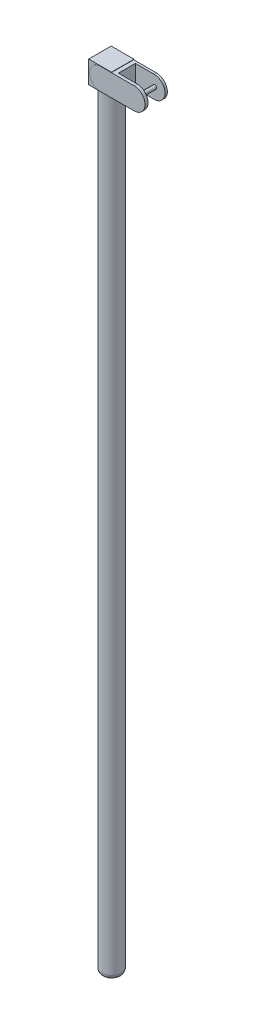
ISO-10303-21;
HEADER;
FILE_DESCRIPTION(('STEP AP214'),'2;1');
FILE_NAME('part.step','',(''),(''),'','','');
FILE_SCHEMA(('AUTOMOTIVE_DESIGN { 1 0 10303 214 1 1 1 1 }'));
ENDSEC;
DATA;
#1=APPLICATION_CONTEXT('core data for automotive mechanical design processes');
#2=APPLICATION_PROTOCOL_DEFINITION('international standard','automotive_design',2000,#1);
#3=PRODUCT_CONTEXT('',#1,'mechanical');
#4=PRODUCT('Part','Part','',(#3));
#5=PRODUCT_RELATED_PRODUCT_CATEGORY('part','',(#4));
#6=PRODUCT_DEFINITION_FORMATION('','',#4);
#7=PRODUCT_DEFINITION_CONTEXT('part definition',#1,'design');
#8=PRODUCT_DEFINITION('design','',#6,#7);
#9=PRODUCT_DEFINITION_SHAPE('','',#8);
#10=(LENGTH_UNIT() NAMED_UNIT(*) SI_UNIT(.MILLI.,.METRE.));
#11=(NAMED_UNIT(*) PLANE_ANGLE_UNIT() SI_UNIT($,.RADIAN.));
#12=(NAMED_UNIT(*) SI_UNIT($,.STERADIAN.) SOLID_ANGLE_UNIT());
#13=UNCERTAINTY_MEASURE_WITH_UNIT(LENGTH_MEASURE(1.E-05),#10,'distance_accuracy_value','');
#14=(GEOMETRIC_REPRESENTATION_CONTEXT(3) GLOBAL_UNCERTAINTY_ASSIGNED_CONTEXT((#13)) GLOBAL_UNIT_ASSIGNED_CONTEXT((#10,
#11,#12)) REPRESENTATION_CONTEXT('',''));
#15=CARTESIAN_POINT('',(0.,0.,0.));
#16=DIRECTION('',(0.,0.,1.));
#17=DIRECTION('',(1.,0.,0.));
#18=AXIS2_PLACEMENT_3D('',#15,#16,#17);
#19=CARTESIAN_POINT('',(7.54764481213233,174.500589944903,2.50000000000003));
#20=DIRECTION('',(0.,0.,-1.));
#21=DIRECTION('',(-1.,0.,0.));
#22=AXIS2_PLACEMENT_3D('',#19,#20,#21);
#23=CYLINDRICAL_SURFACE('',#22,2.43482059755223);
#24=DIRECTION('',(0.,0.,-1.));
#25=VECTOR('',#24,1.);
#26=CARTESIAN_POINT('',(7.54764481213233,176.935410542455,2.50000000000003));
#27=LINE('',#26,#25);
#28=CARTESIAN_POINT('',(7.54764481213233,176.935410542455,-1.97287008939884));
#29=VERTEX_POINT('',#28);
#30=CARTESIAN_POINT('',(7.54764481213233,176.935410542455,-2.50000000000003));
#31=VERTEX_POINT('',#30);
#32=EDGE_CURVE('E194',#29,#31,#27,.T.);
#33=ORIENTED_EDGE('',*,*,#32,.F.);
#34=CARTESIAN_POINT('',(7.54764481213233,174.500589944903,-1.97287008939884));
#35=DIRECTION('',(0.,0.,-1.));
#36=DIRECTION('',(-1.,0.,0.));
#37=AXIS2_PLACEMENT_3D('',#34,#35,#36);
#38=CIRCLE('',#37,2.43482059755223);
#39=CARTESIAN_POINT('',(7.54764481213233,172.06576934735,-1.97287008939884));
#40=VERTEX_POINT('',#39);
#41=EDGE_CURVE('E168',#29,#40,#38,.T.);
#42=ORIENTED_EDGE('',*,*,#41,.T.);
#43=DIRECTION('',(0.,0.,-1.));
#44=VECTOR('',#43,1.);
#45=CARTESIAN_POINT('',(7.54764481213233,172.06576934735,2.50000000000003));
#46=LINE('',#45,#44);
#47=CARTESIAN_POINT('',(7.54764481213233,172.06576934735,-2.50000000000003));
#48=VERTEX_POINT('',#47);
#49=EDGE_CURVE('E196',#40,#48,#46,.T.);
#50=ORIENTED_EDGE('',*,*,#49,.T.);
#51=CARTESIAN_POINT('',(7.54764481213233,174.500589944903,-2.50000000000003));
#52=DIRECTION('',(0.,0.,1.));
#53=DIRECTION('',(1.,0.,0.));
#54=AXIS2_PLACEMENT_3D('',#51,#52,#53);
#55=CIRCLE('',#54,2.43482059755223);
#56=EDGE_CURVE('E188',#48,#31,#55,.T.);
#57=ORIENTED_EDGE('',*,*,#56,.T.);
#58=EDGE_LOOP('',(#33,#42,#50,#57));
#59=FACE_BOUND('',#58,.T.);
#60=ADVANCED_FACE('F37',(#59),#23,.T.);
#61=CARTESIAN_POINT('',(2.44924478924003,172.,-2.5736655947117));
#62=DIRECTION('',(1.,0.,0.));
#63=DIRECTION('',(0.,0.,-1.));
#64=AXIS2_PLACEMENT_3D('',#61,#62,#63);
#65=PLANE('',#64);
#66=DIRECTION('',(0.,-1.,0.));
#67=VECTOR('',#66,1.);
#68=CARTESIAN_POINT('',(2.44924478924003,172.,-2.50000000000003));
#69=LINE('',#68,#67);
#70=CARTESIAN_POINT('',(2.44924478924003,176.935410542455,-2.50000000000003));
#71=VERTEX_POINT('',#70);
#72=CARTESIAN_POINT('',(2.44924478924003,172.06576934735,-2.50000000000003));
#73=VERTEX_POINT('',#72);
#74=EDGE_CURVE('E46',#71,#73,#69,.T.);
#75=ORIENTED_EDGE('',*,*,#74,.T.);
#76=DIRECTION('',(0.,0.,1.));
#77=VECTOR('',#76,1.);
#78=CARTESIAN_POINT('',(2.44924478924003,172.06576934735,-2.5736655947117));
#79=LINE('',#78,#77);
#80=CARTESIAN_POINT('',(2.44924478924003,172.06576934735,2.46932220142265));
#81=VERTEX_POINT('',#80);
#82=EDGE_CURVE('E204',#73,#81,#79,.T.);
#83=ORIENTED_EDGE('',*,*,#82,.T.);
#84=DIRECTION('',(0.,1.,0.));
#85=VECTOR('',#84,1.);
#86=CARTESIAN_POINT('',(2.44924478924003,172.,2.46932220142265));
#87=LINE('',#86,#85);
#88=CARTESIAN_POINT('',(2.44924478924003,172.,2.46932220142265));
#89=VERTEX_POINT('',#88);
#90=EDGE_CURVE('E237',#89,#81,#87,.T.);
#91=ORIENTED_EDGE('',*,*,#90,.F.);
#92=DIRECTION('',(0.,0.,-1.));
#93=VECTOR('',#92,1.);
#94=CARTESIAN_POINT('',(2.44924478924003,172.,-2.5736655947117));
#95=LINE('',#94,#93);
#96=CARTESIAN_POINT('',(2.44924478924003,172.,-2.5736655947117));
#97=VERTEX_POINT('',#96);
#98=EDGE_CURVE('E215',#89,#97,#95,.T.);
#99=ORIENTED_EDGE('',*,*,#98,.T.);
#100=DIRECTION('',(0.,1.,0.));
#101=VECTOR('',#100,1.);
#102=CARTESIAN_POINT('',(2.44924478924003,172.,-2.5736655947117));
#103=LINE('',#102,#101);
#104=CARTESIAN_POINT('',(2.44924478924003,177.,-2.5736655947117));
#105=VERTEX_POINT('',#104);
#106=EDGE_CURVE('E235',#97,#105,#103,.T.);
#107=ORIENTED_EDGE('',*,*,#106,.T.);
#108=DIRECTION('',(0.,0.,-1.));
#109=VECTOR('',#108,1.);
#110=CARTESIAN_POINT('',(2.44924478924003,177.,-2.5736655947117));
#111=LINE('',#110,#109);
#112=CARTESIAN_POINT('',(2.44924478924003,177.,2.46932220142265));
#113=VERTEX_POINT('',#112);
#114=EDGE_CURVE('E227',#113,#105,#111,.T.);
#115=ORIENTED_EDGE('',*,*,#114,.F.);
#116=CARTESIAN_POINT('',(2.44924478924003,176.935410542455,2.46932220142265));
#117=VERTEX_POINT('',#116);
#118=EDGE_CURVE('E240',#117,#113,#87,.T.);
#119=ORIENTED_EDGE('',*,*,#118,.F.);
#120=DIRECTION('',(0.,0.,-1.));
#121=VECTOR('',#120,1.);
#122=CARTESIAN_POINT('',(2.44924478924003,176.935410542455,-2.5736655947117));
#123=LINE('',#122,#121);
#124=EDGE_CURVE('E61',#117,#71,#123,.T.);
#125=ORIENTED_EDGE('',*,*,#124,.T.);
#126=EDGE_LOOP('',(#75,#83,#91,#99,#107,#115,#119,#125));
#127=FACE_BOUND('',#126,.T.);
#128=ADVANCED_FACE('F260',(#127),#65,.T.);
#129=CARTESIAN_POINT('',(-2.66599211572145,172.,2.46932220142265));
#130=DIRECTION('',(0.,0.,1.));
#131=DIRECTION('',(1.,0.,0.));
#132=AXIS2_PLACEMENT_3D('',#129,#130,#131);
#133=PLANE('',#132);
#134=ORIENTED_EDGE('',*,*,#90,.T.);
#135=DIRECTION('',(-1.,0.,0.));
#136=VECTOR('',#135,1.);
#137=CARTESIAN_POINT('',(-2.66599211572145,172.06576934735,2.46932220142265));
#138=LINE('',#137,#136);
#139=CARTESIAN_POINT('',(0.,172.06576934735,2.46932220142265));
#140=VERTEX_POINT('',#139);
#141=EDGE_CURVE('E255',#81,#140,#138,.T.);
#142=ORIENTED_EDGE('',*,*,#141,.T.);
#143=CARTESIAN_POINT('',(0.,174.500589944903,2.46932220142265));
#144=DIRECTION('',(0.,0.,1.));
#145=DIRECTION('',(1.,0.,0.));
#146=AXIS2_PLACEMENT_3D('',#143,#144,#145);
#147=CIRCLE('',#146,2.43482059755223);
#148=CARTESIAN_POINT('',(0.,176.935410542455,2.46932220142265));
#149=VERTEX_POINT('',#148);
#150=EDGE_CURVE('E252',#140,#149,#147,.F.);
#151=ORIENTED_EDGE('',*,*,#150,.T.);
#152=DIRECTION('',(1.,0.,0.));
#153=VECTOR('',#152,1.);
#154=CARTESIAN_POINT('',(-2.66599211572145,176.935410542455,2.46932220142265));
#155=LINE('',#154,#153);
#156=EDGE_CURVE('E250',#149,#117,#155,.T.);
#157=ORIENTED_EDGE('',*,*,#156,.T.);
#158=ORIENTED_EDGE('',*,*,#118,.T.);
#159=DIRECTION('',(1.,0.,0.));
#160=VECTOR('',#159,1.);
#161=CARTESIAN_POINT('',(-2.66599211572145,177.,2.46932220142265));
#162=LINE('',#161,#160);
#163=CARTESIAN_POINT('',(-2.66599211572145,177.,2.46932220142265));
#164=VERTEX_POINT('',#163);
#165=EDGE_CURVE('E224',#164,#113,#162,.T.);
#166=ORIENTED_EDGE('',*,*,#165,.F.);
#167=DIRECTION('',(0.,1.,0.));
#168=VECTOR('',#167,1.);
#169=CARTESIAN_POINT('',(-2.66599211572145,172.,2.46932220142265));
#170=LINE('',#169,#168);
#171=CARTESIAN_POINT('',(-2.66599211572145,172.,2.46932220142265));
#172=VERTEX_POINT('',#171);
#173=EDGE_CURVE('E221',#172,#164,#170,.T.);
#174=ORIENTED_EDGE('',*,*,#173,.F.);
#175=DIRECTION('',(1.,0.,0.));
#176=VECTOR('',#175,1.);
#177=CARTESIAN_POINT('',(-2.66599211572145,172.,2.46932220142265));
#178=LINE('',#177,#176);
#179=EDGE_CURVE('E211',#172,#89,#178,.T.);
#180=ORIENTED_EDGE('',*,*,#179,.T.);
#181=EDGE_LOOP('',(#134,#142,#151,#157,#158,#166,#174,#180));
#182=FACE_BOUND('',#181,.T.);
#183=ADVANCED_FACE('F274',(#182),#133,.T.);
#184=CARTESIAN_POINT('',(0.,177.,0.));
#185=DIRECTION('',(0.,-1.,0.));
#186=DIRECTION('',(0.,0.,-1.));
#187=AXIS2_PLACEMENT_3D('',#184,#185,#186);
#188=CYLINDRICAL_SURFACE('',#187,2.18750858516951);
#189=CARTESIAN_POINT('',(0.,1.,0.));
#190=DIRECTION('',(0.,1.,0.));
#191=DIRECTION('',(0.,0.,1.));
#192=AXIS2_PLACEMENT_3D('',#189,#190,#191);
#193=CIRCLE('',#192,2.18750858516951);
#194=CARTESIAN_POINT('',(0.,1.,2.18750858516951));
#195=VERTEX_POINT('',#194);
#196=EDGE_CURVE('E234',#195,#195,#193,.T.);
#197=ORIENTED_EDGE('',*,*,#196,.T.);
#198=EDGE_LOOP('',(#197));
#199=FACE_BOUND('',#198,.T.);
#200=CARTESIAN_POINT('',(0.,172.,0.));
#201=DIRECTION('',(0.,1.,0.));
#202=DIRECTION('',(0.,0.,1.));
#203=AXIS2_PLACEMENT_3D('',#200,#201,#202);
#204=CIRCLE('',#203,2.18750858516951);
#205=CARTESIAN_POINT('',(0.,172.,2.18750858516951));
#206=VERTEX_POINT('',#205);
#207=EDGE_CURVE('E247',#206,#206,#204,.T.);
#208=ORIENTED_EDGE('',*,*,#207,.F.);
#209=EDGE_LOOP('',(#208));
#210=FACE_BOUND('',#209,.T.);
#211=ADVANCED_FACE('F341',(#199,#210),#188,.T.);
#212=CARTESIAN_POINT('',(0.,0.,0.));
#213=DIRECTION('',(0.,1.,0.));
#214=DIRECTION('',(0.,0.,1.));
#215=AXIS2_PLACEMENT_3D('',#212,#213,#214);
#216=PLANE('',#215);
#217=CARTESIAN_POINT('',(0.,0.,0.));
#218=DIRECTION('',(0.,1.,0.));
#219=DIRECTION('',(0.,0.,1.));
#220=AXIS2_PLACEMENT_3D('',#217,#218,#219);
#221=CIRCLE('',#220,1.18750858516951);
#222=CARTESIAN_POINT('',(0.,0.,1.18750858516951));
#223=VERTEX_POINT('',#222);
#224=EDGE_CURVE('E244',#223,#223,#221,.F.);
#225=ORIENTED_EDGE('',*,*,#224,.T.);
#226=EDGE_LOOP('',(#225));
#227=FACE_BOUND('',#226,.T.);
#228=ADVANCED_FACE('F347',(#227),#216,.F.);
#229=CARTESIAN_POINT('',(0.,1.,0.));
#230=DIRECTION('',(0.,1.,0.));
#231=DIRECTION('',(0.,0.,1.));
#232=AXIS2_PLACEMENT_3D('',#229,#230,#231);
#233=TOROIDAL_SURFACE('',#232,1.18750858516951,1.);
#234=ORIENTED_EDGE('',*,*,#224,.F.);
#235=EDGE_LOOP('',(#234));
#236=FACE_BOUND('',#235,.T.);
#237=ORIENTED_EDGE('',*,*,#196,.F.);
#238=EDGE_LOOP('',(#237));
#239=FACE_BOUND('',#238,.T.);
#240=ADVANCED_FACE('F39',(#236,#239),#233,.T.);
#241=CARTESIAN_POINT('',(-2.66599211572145,172.,-2.5736655947117));
#242=DIRECTION('',(-1.,0.,0.));
#243=DIRECTION('',(0.,0.,1.));
#244=AXIS2_PLACEMENT_3D('',#241,#242,#243);
#245=PLANE('',#244);
#246=DIRECTION('',(0.,0.,1.));
#247=VECTOR('',#246,1.);
#248=CARTESIAN_POINT('',(-2.66599211572145,177.,-2.5736655947117));
#249=LINE('',#248,#247);
#250=CARTESIAN_POINT('',(-2.66599211572145,177.,-2.5736655947117));
#251=VERTEX_POINT('',#250);
#252=EDGE_CURVE('E207',#251,#164,#249,.T.);
#253=ORIENTED_EDGE('',*,*,#252,.F.);
#254=DIRECTION('',(0.,1.,0.));
#255=VECTOR('',#254,1.);
#256=CARTESIAN_POINT('',(-2.66599211572145,172.,-2.5736655947117));
#257=LINE('',#256,#255);
#258=CARTESIAN_POINT('',(-2.66599211572145,172.,-2.5736655947117));
#259=VERTEX_POINT('',#258);
#260=EDGE_CURVE('E232',#259,#251,#257,.T.);
#261=ORIENTED_EDGE('',*,*,#260,.F.);
#262=DIRECTION('',(0.,0.,1.));
#263=VECTOR('',#262,1.);
#264=CARTESIAN_POINT('',(-2.66599211572145,172.,-2.5736655947117));
#265=LINE('',#264,#263);
#266=EDGE_CURVE('E208',#259,#172,#265,.T.);
#267=ORIENTED_EDGE('',*,*,#266,.T.);
#268=ORIENTED_EDGE('',*,*,#173,.T.);
#269=EDGE_LOOP('',(#253,#261,#267,#268));
#270=FACE_BOUND('',#269,.T.);
#271=ADVANCED_FACE('F337',(#270),#245,.T.);
#272=CARTESIAN_POINT('',(-2.66599211572145,172.,-2.5736655947117));
#273=DIRECTION('',(0.,0.,-1.));
#274=DIRECTION('',(-1.,0.,0.));
#275=AXIS2_PLACEMENT_3D('',#272,#273,#274);
#276=PLANE('',#275);
#277=DIRECTION('',(-1.,0.,0.));
#278=VECTOR('',#277,1.);
#279=CARTESIAN_POINT('',(-2.66599211572145,177.,-2.5736655947117));
#280=LINE('',#279,#278);
#281=EDGE_CURVE('E212',#105,#251,#280,.T.);
#282=ORIENTED_EDGE('',*,*,#281,.F.);
#283=ORIENTED_EDGE('',*,*,#106,.F.);
#284=DIRECTION('',(-1.,0.,0.));
#285=VECTOR('',#284,1.);
#286=CARTESIAN_POINT('',(-2.66599211572145,172.,-2.5736655947117));
#287=LINE('',#286,#285);
#288=EDGE_CURVE('E218',#97,#259,#287,.T.);
#289=ORIENTED_EDGE('',*,*,#288,.T.);
#290=ORIENTED_EDGE('',*,*,#260,.T.);
#291=EDGE_LOOP('',(#282,#283,#289,#290));
#292=FACE_BOUND('',#291,.T.);
#293=ADVANCED_FACE('F283',(#292),#276,.T.);
#294=CARTESIAN_POINT('',(0.,172.,0.));
#295=DIRECTION('',(0.,1.,0.));
#296=DIRECTION('',(0.,0.,1.));
#297=AXIS2_PLACEMENT_3D('',#294,#295,#296);
#298=PLANE('',#297);
#299=ORIENTED_EDGE('',*,*,#207,.T.);
#300=EDGE_LOOP('',(#299));
#301=FACE_BOUND('',#300,.T.);
#302=ORIENTED_EDGE('',*,*,#266,.F.);
#303=ORIENTED_EDGE('',*,*,#288,.F.);
#304=ORIENTED_EDGE('',*,*,#98,.F.);
#305=ORIENTED_EDGE('',*,*,#179,.F.);
#306=EDGE_LOOP('',(#302,#303,#304,#305));
#307=FACE_BOUND('',#306,.T.);
#308=ADVANCED_FACE('F280',(#301,#307),#298,.F.);
#309=CARTESIAN_POINT('',(0.,177.,0.));
#310=DIRECTION('',(0.,1.,0.));
#311=DIRECTION('',(0.,0.,1.));
#312=AXIS2_PLACEMENT_3D('',#309,#310,#311);
#313=PLANE('',#312);
#314=ORIENTED_EDGE('',*,*,#252,.T.);
#315=ORIENTED_EDGE('',*,*,#165,.T.);
#316=ORIENTED_EDGE('',*,*,#114,.T.);
#317=ORIENTED_EDGE('',*,*,#281,.T.);
#318=EDGE_LOOP('',(#314,#315,#316,#317));
#319=FACE_BOUND('',#318,.T.);
#320=ADVANCED_FACE('F287',(#319),#313,.T.);
#321=CARTESIAN_POINT('',(0.,174.500589944903,2.50000000000003));
#322=DIRECTION('',(0.,0.,-1.));
#323=DIRECTION('',(-1.,0.,0.));
#324=AXIS2_PLACEMENT_3D('',#321,#322,#323);
#325=CYLINDRICAL_SURFACE('',#324,2.43482059755223);
#326=ORIENTED_EDGE('',*,*,#150,.F.);
#327=DIRECTION('',(0.,0.,-1.));
#328=VECTOR('',#327,1.);
#329=CARTESIAN_POINT('',(0.,172.06576934735,2.50000000000003));
#330=LINE('',#329,#328);
#331=CARTESIAN_POINT('',(0.,172.06576934735,2.50000000000003));
#332=VERTEX_POINT('',#331);
#333=EDGE_CURVE('E200',#332,#140,#330,.T.);
#334=ORIENTED_EDGE('',*,*,#333,.F.);
#335=CARTESIAN_POINT('',(0.,174.500589944903,2.50000000000003));
#336=DIRECTION('',(0.,0.,1.));
#337=DIRECTION('',(1.,0.,0.));
#338=AXIS2_PLACEMENT_3D('',#335,#336,#337);
#339=CIRCLE('',#338,2.43482059755223);
#340=CARTESIAN_POINT('',(0.,176.935410542455,2.50000000000003));
#341=VERTEX_POINT('',#340);
#342=EDGE_CURVE('E175',#341,#332,#339,.T.);
#343=ORIENTED_EDGE('',*,*,#342,.F.);
#344=DIRECTION('',(0.,0.,-1.));
#345=VECTOR('',#344,1.);
#346=CARTESIAN_POINT('',(0.,176.935410542455,2.50000000000003));
#347=LINE('',#346,#345);
#348=EDGE_CURVE('E185',#341,#149,#347,.T.);
#349=ORIENTED_EDGE('',*,*,#348,.T.);
#350=EDGE_LOOP('',(#326,#334,#343,#349));
#351=FACE_BOUND('',#350,.T.);
#352=ADVANCED_FACE('F292',(#351),#325,.T.);
#353=CARTESIAN_POINT('',(0.,172.06576934735,2.50000000000003));
#354=DIRECTION('',(0.,1.,0.));
#355=DIRECTION('',(0.,0.,1.));
#356=AXIS2_PLACEMENT_3D('',#353,#354,#355);
#357=PLANE('',#356);
#358=ORIENTED_EDGE('',*,*,#49,.F.);
#359=DIRECTION('',(-1.,0.,0.));
#360=VECTOR('',#359,1.);
#361=CARTESIAN_POINT('',(0.,172.06576934735,-1.97287008939884));
#362=LINE('',#361,#360);
#363=CARTESIAN_POINT('',(3.34185481848968,172.06576934735,-1.97287008939884));
#364=VERTEX_POINT('',#363);
#365=EDGE_CURVE('E171',#40,#364,#362,.T.);
#366=ORIENTED_EDGE('',*,*,#365,.T.);
#367=DIRECTION('',(0.,0.,1.));
#368=VECTOR('',#367,1.);
#369=CARTESIAN_POINT('',(3.34185481848968,172.06576934735,2.50000000000003));
#370=LINE('',#369,#368);
#371=CARTESIAN_POINT('',(3.34185481848968,172.06576934735,1.81597989444794));
#372=VERTEX_POINT('',#371);
#373=EDGE_CURVE('E148',#364,#372,#370,.T.);
#374=ORIENTED_EDGE('',*,*,#373,.T.);
#375=DIRECTION('',(1.,0.,0.));
#376=VECTOR('',#375,1.);
#377=CARTESIAN_POINT('',(0.,172.06576934735,1.81597989444794));
#378=LINE('',#377,#376);
#379=CARTESIAN_POINT('',(7.54764481213233,172.06576934735,1.81597989444794));
#380=VERTEX_POINT('',#379);
#381=EDGE_CURVE('E146',#372,#380,#378,.T.);
#382=ORIENTED_EDGE('',*,*,#381,.T.);
#383=CARTESIAN_POINT('',(7.54764481213233,172.06576934735,2.50000000000003));
#384=VERTEX_POINT('',#383);
#385=EDGE_CURVE('E197',#384,#380,#46,.T.);
#386=ORIENTED_EDGE('',*,*,#385,.F.);
#387=DIRECTION('',(1.,0.,0.));
#388=VECTOR('',#387,1.);
#389=CARTESIAN_POINT('',(0.,172.06576934735,2.50000000000003));
#390=LINE('',#389,#388);
#391=EDGE_CURVE('E178',#332,#384,#390,.T.);
#392=ORIENTED_EDGE('',*,*,#391,.F.);
#393=ORIENTED_EDGE('',*,*,#333,.T.);
#394=ORIENTED_EDGE('',*,*,#141,.F.);
#395=ORIENTED_EDGE('',*,*,#82,.F.);
#396=DIRECTION('',(1.,0.,0.));
#397=VECTOR('',#396,1.);
#398=CARTESIAN_POINT('',(0.,172.06576934735,-2.50000000000003));
#399=LINE('',#398,#397);
#400=EDGE_CURVE('E174',#73,#48,#399,.T.);
#401=ORIENTED_EDGE('',*,*,#400,.T.);
#402=EDGE_LOOP('',(#358,#366,#374,#382,#386,#392,#393,#394,#395,#401));
#403=FACE_BOUND('',#402,.T.);
#404=ADVANCED_FACE('F271',(#403),#357,.F.);
#405=ORIENTED_EDGE('',*,*,#385,.T.);
#406=CARTESIAN_POINT('',(7.54764481213233,174.500589944903,1.81597989444794));
#407=DIRECTION('',(0.,0.,1.));
#408=DIRECTION('',(1.,0.,0.));
#409=AXIS2_PLACEMENT_3D('',#406,#407,#408);
#410=CIRCLE('',#409,2.43482059755223);
#411=CARTESIAN_POINT('',(7.54764481213233,176.935410542455,1.81597989444794));
#412=VERTEX_POINT('',#411);
#413=EDGE_CURVE('E165',#380,#412,#410,.T.);
#414=ORIENTED_EDGE('',*,*,#413,.T.);
#415=CARTESIAN_POINT('',(7.54764481213233,176.935410542455,2.50000000000003));
#416=VERTEX_POINT('',#415);
#417=EDGE_CURVE('E159',#416,#412,#27,.T.);
#418=ORIENTED_EDGE('',*,*,#417,.F.);
#419=CARTESIAN_POINT('',(7.54764481213233,174.500589944903,2.50000000000003));
#420=DIRECTION('',(0.,0.,1.));
#421=DIRECTION('',(1.,0.,0.));
#422=AXIS2_PLACEMENT_3D('',#419,#420,#421);
#423=CIRCLE('',#422,2.43482059755223);
#424=EDGE_CURVE('E181',#384,#416,#423,.T.);
#425=ORIENTED_EDGE('',*,*,#424,.F.);
#426=EDGE_LOOP('',(#405,#414,#418,#425));
#427=FACE_BOUND('',#426,.T.);
#428=ADVANCED_FACE('F298',(#427),#23,.T.);
#429=CARTESIAN_POINT('',(0.,176.935410542455,2.50000000000003));
#430=DIRECTION('',(0.,-1.,0.));
#431=DIRECTION('',(0.,0.,-1.));
#432=AXIS2_PLACEMENT_3D('',#429,#430,#431);
#433=PLANE('',#432);
#434=DIRECTION('',(0.,0.,1.));
#435=VECTOR('',#434,1.);
#436=CARTESIAN_POINT('',(3.34185481848968,176.935410542455,-1.97287008939884));
#437=LINE('',#436,#435);
#438=CARTESIAN_POINT('',(3.34185481848968,176.935410542455,-1.97287008939884));
#439=VERTEX_POINT('',#438);
#440=CARTESIAN_POINT('',(3.34185481848968,176.935410542455,1.81597989444794));
#441=VERTEX_POINT('',#440);
#442=EDGE_CURVE('E151',#439,#441,#437,.T.);
#443=ORIENTED_EDGE('',*,*,#442,.F.);
#444=DIRECTION('',(1.,0.,0.));
#445=VECTOR('',#444,1.);
#446=CARTESIAN_POINT('',(0.,176.935410542455,-1.97287008939884));
#447=LINE('',#446,#445);
#448=EDGE_CURVE('E11',#439,#29,#447,.T.);
#449=ORIENTED_EDGE('',*,*,#448,.T.);
#450=ORIENTED_EDGE('',*,*,#32,.T.);
#451=DIRECTION('',(-1.,0.,0.));
#452=VECTOR('',#451,1.);
#453=CARTESIAN_POINT('',(0.,176.935410542455,-2.50000000000003));
#454=LINE('',#453,#452);
#455=EDGE_CURVE('E179',#31,#71,#454,.T.);
#456=ORIENTED_EDGE('',*,*,#455,.T.);
#457=ORIENTED_EDGE('',*,*,#124,.F.);
#458=ORIENTED_EDGE('',*,*,#156,.F.);
#459=ORIENTED_EDGE('',*,*,#348,.F.);
#460=DIRECTION('',(-1.,0.,0.));
#461=VECTOR('',#460,1.);
#462=CARTESIAN_POINT('',(0.,176.935410542455,2.50000000000003));
#463=LINE('',#462,#461);
#464=EDGE_CURVE('E183',#416,#341,#463,.T.);
#465=ORIENTED_EDGE('',*,*,#464,.F.);
#466=ORIENTED_EDGE('',*,*,#417,.T.);
#467=DIRECTION('',(1.,0.,0.));
#468=VECTOR('',#467,1.);
#469=CARTESIAN_POINT('',(3.34185481848968,176.935410542455,1.81597989444794));
#470=LINE('',#469,#468);
#471=EDGE_CURVE('E143',#441,#412,#470,.T.);
#472=ORIENTED_EDGE('',*,*,#471,.F.);
#473=EDGE_LOOP('',(#443,#449,#450,#456,#457,#458,#459,#465,#466,#472));
#474=FACE_BOUND('',#473,.T.);
#475=ADVANCED_FACE('F156',(#474),#433,.F.);
#476=CARTESIAN_POINT('',(0.,174.500589944903,2.50000000000003));
#477=DIRECTION('',(0.,0.,1.));
#478=DIRECTION('',(1.,0.,0.));
#479=AXIS2_PLACEMENT_3D('',#476,#477,#478);
#480=PLANE('',#479);
#481=ORIENTED_EDGE('',*,*,#342,.T.);
#482=ORIENTED_EDGE('',*,*,#391,.T.);
#483=ORIENTED_EDGE('',*,*,#424,.T.);
#484=ORIENTED_EDGE('',*,*,#464,.T.);
#485=EDGE_LOOP('',(#481,#482,#483,#484));
#486=FACE_BOUND('',#485,.T.);
#487=ADVANCED_FACE('F294',(#486),#480,.T.);
#488=CARTESIAN_POINT('',(0.,174.500589944903,-2.50000000000003));
#489=DIRECTION('',(0.,0.,1.));
#490=DIRECTION('',(1.,0.,0.));
#491=AXIS2_PLACEMENT_3D('',#488,#489,#490);
#492=PLANE('',#491);
#493=ORIENTED_EDGE('',*,*,#74,.F.);
#494=ORIENTED_EDGE('',*,*,#455,.F.);
#495=ORIENTED_EDGE('',*,*,#56,.F.);
#496=ORIENTED_EDGE('',*,*,#400,.F.);
#497=EDGE_LOOP('',(#493,#494,#495,#496));
#498=FACE_BOUND('',#497,.T.);
#499=ADVANCED_FACE('F265',(#498),#492,.F.);
#500=CARTESIAN_POINT('',(3.34185481848968,171.935410542455,-1.97287008939884));
#501=DIRECTION('',(0.,0.,-1.));
#502=DIRECTION('',(-1.,0.,0.));
#503=AXIS2_PLACEMENT_3D('',#500,#501,#502);
#504=PLANE('',#503);
#505=CARTESIAN_POINT('',(7.70281672818238,174.562062813015,-1.97287008939884));
#506=DIRECTION('',(0.,0.,-1.));
#507=DIRECTION('',(-1.,0.,0.));
#508=AXIS2_PLACEMENT_3D('',#505,#506,#507);
#509=CIRCLE('',#508,0.420224292057396);
#510=CARTESIAN_POINT('',(7.28259243612498,174.562062813015,-1.97287008939884));
#511=VERTEX_POINT('',#510);
#512=EDGE_CURVE('E153',#511,#511,#509,.T.);
#513=ORIENTED_EDGE('',*,*,#512,.T.);
#514=EDGE_LOOP('',(#513));
#515=FACE_BOUND('',#514,.T.);
#516=ORIENTED_EDGE('',*,*,#41,.F.);
#517=ORIENTED_EDGE('',*,*,#448,.F.);
#518=DIRECTION('',(0.,1.,0.));
#519=VECTOR('',#518,1.);
#520=CARTESIAN_POINT('',(3.34185481848968,171.935410542455,-1.97287008939884));
#521=LINE('',#520,#519);
#522=EDGE_CURVE('E53',#364,#439,#521,.T.);
#523=ORIENTED_EDGE('',*,*,#522,.F.);
#524=ORIENTED_EDGE('',*,*,#365,.F.);
#525=EDGE_LOOP('',(#516,#517,#523,#524));
#526=FACE_BOUND('',#525,.T.);
#527=ADVANCED_FACE('F300',(#515,#526),#504,.F.);
#528=CARTESIAN_POINT('',(3.34185481848968,171.935410542455,1.81597989444794));
#529=DIRECTION('',(0.,0.,1.));
#530=DIRECTION('',(1.,0.,0.));
#531=AXIS2_PLACEMENT_3D('',#528,#529,#530);
#532=PLANE('',#531);
#533=CARTESIAN_POINT('',(7.70281672818238,174.562062813015,1.81597989444794));
#534=DIRECTION('',(0.,0.,1.));
#535=DIRECTION('',(1.,0.,0.));
#536=AXIS2_PLACEMENT_3D('',#533,#534,#535);
#537=CIRCLE('',#536,0.420224292057396);
#538=CARTESIAN_POINT('',(8.12304102023977,174.562062813015,1.81597989444794));
#539=VERTEX_POINT('',#538);
#540=EDGE_CURVE('E41',#539,#539,#537,.T.);
#541=ORIENTED_EDGE('',*,*,#540,.T.);
#542=EDGE_LOOP('',(#541));
#543=FACE_BOUND('',#542,.T.);
#544=DIRECTION('',(0.,1.,0.));
#545=VECTOR('',#544,1.);
#546=CARTESIAN_POINT('',(3.34185481848968,171.935410542455,1.81597989444794));
#547=LINE('',#546,#545);
#548=EDGE_CURVE('E140',#372,#441,#547,.T.);
#549=ORIENTED_EDGE('',*,*,#548,.T.);
#550=ORIENTED_EDGE('',*,*,#471,.T.);
#551=ORIENTED_EDGE('',*,*,#413,.F.);
#552=ORIENTED_EDGE('',*,*,#381,.F.);
#553=EDGE_LOOP('',(#549,#550,#551,#552));
#554=FACE_BOUND('',#553,.T.);
#555=ADVANCED_FACE('F141',(#543,#554),#532,.F.);
#556=CARTESIAN_POINT('',(3.34185481848968,171.935410542455,-1.97287008939884));
#557=DIRECTION('',(-1.,0.,0.));
#558=DIRECTION('',(0.,0.,1.));
#559=AXIS2_PLACEMENT_3D('',#556,#557,#558);
#560=PLANE('',#559);
#561=ORIENTED_EDGE('',*,*,#522,.T.);
#562=ORIENTED_EDGE('',*,*,#442,.T.);
#563=ORIENTED_EDGE('',*,*,#548,.F.);
#564=ORIENTED_EDGE('',*,*,#373,.F.);
#565=EDGE_LOOP('',(#561,#562,#563,#564));
#566=FACE_BOUND('',#565,.T.);
#567=ADVANCED_FACE('F152',(#566),#560,.F.);
#568=CARTESIAN_POINT('',(7.70281672818238,174.562062813015,-2.50000000000003));
#569=DIRECTION('',(0.,0.,1.));
#570=DIRECTION('',(1.,0.,0.));
#571=AXIS2_PLACEMENT_3D('',#568,#569,#570);
#572=CYLINDRICAL_SURFACE('',#571,0.420224292057396);
#573=ORIENTED_EDGE('',*,*,#540,.F.);
#574=EDGE_LOOP('',(#573));
#575=FACE_BOUND('',#574,.T.);
#576=ORIENTED_EDGE('',*,*,#512,.F.);
#577=EDGE_LOOP('',(#576));
#578=FACE_BOUND('',#577,.T.);
#579=ADVANCED_FACE('F467',(#575,#578),#572,.T.);
#580=CLOSED_SHELL('',(#60,#128,#183,#211,#228,#240,#271,#293,#308,#320,#352,#404,#428,#475,#487,
#499,#527,#555,#567,#579));
#581=MANIFOLD_SOLID_BREP('B2',#580);
#582=ADVANCED_BREP_SHAPE_REPRESENTATION('',(#18,#581),#14);
#583=SHAPE_DEFINITION_REPRESENTATION(#9,#582);
ENDSEC;
END-ISO-10303-21;
